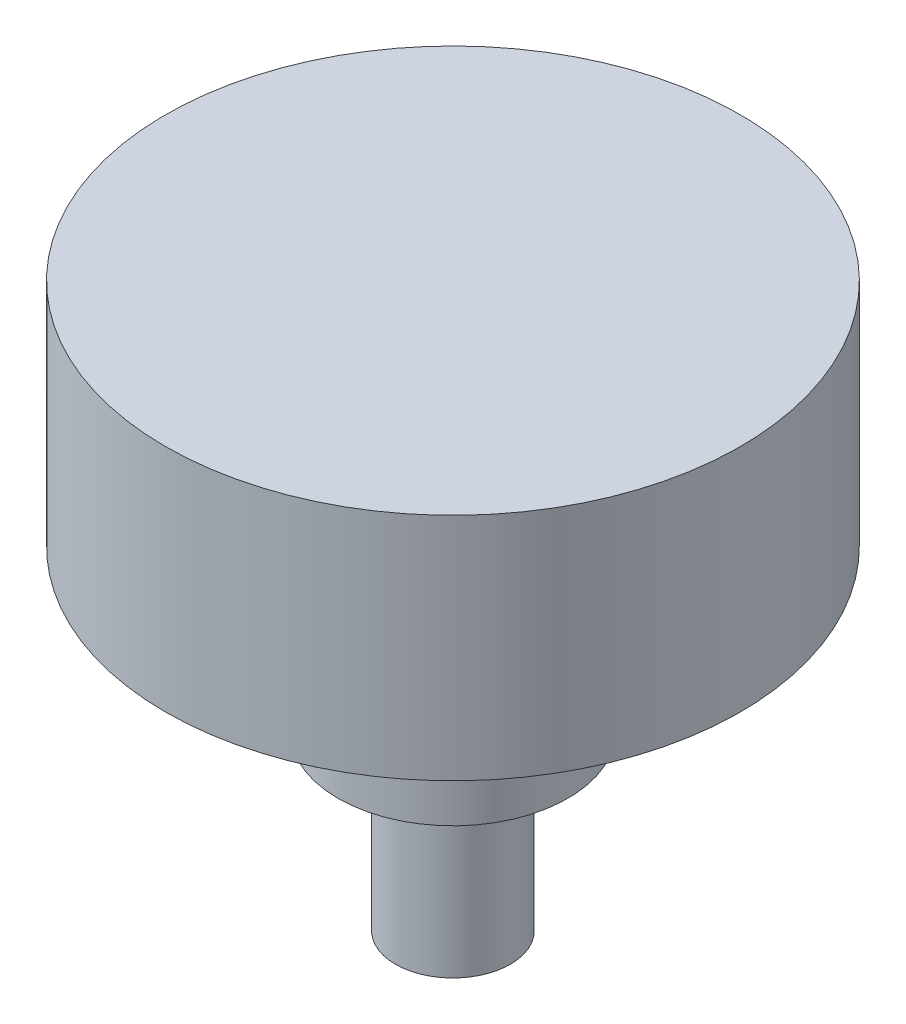
ISO-10303-21;
HEADER;
FILE_DESCRIPTION(('STEP AP214'),'2;1');
FILE_NAME('part.step','',(''),(''),'','','');
FILE_SCHEMA(('AUTOMOTIVE_DESIGN { 1 0 10303 214 1 1 1 1 }'));
ENDSEC;
DATA;
#1=APPLICATION_CONTEXT('core data for automotive mechanical design processes');
#2=APPLICATION_PROTOCOL_DEFINITION('international standard','automotive_design',2000,#1);
#3=PRODUCT_CONTEXT('',#1,'mechanical');
#4=PRODUCT('Part','Part','',(#3));
#5=PRODUCT_RELATED_PRODUCT_CATEGORY('part','',(#4));
#6=PRODUCT_DEFINITION_FORMATION('','',#4);
#7=PRODUCT_DEFINITION_CONTEXT('part definition',#1,'design');
#8=PRODUCT_DEFINITION('design','',#6,#7);
#9=PRODUCT_DEFINITION_SHAPE('','',#8);
#10=(LENGTH_UNIT() NAMED_UNIT(*) SI_UNIT(.MILLI.,.METRE.));
#11=(NAMED_UNIT(*) PLANE_ANGLE_UNIT() SI_UNIT($,.RADIAN.));
#12=(NAMED_UNIT(*) SI_UNIT($,.STERADIAN.) SOLID_ANGLE_UNIT());
#13=UNCERTAINTY_MEASURE_WITH_UNIT(LENGTH_MEASURE(1.E-05),#10,'distance_accuracy_value','');
#14=(GEOMETRIC_REPRESENTATION_CONTEXT(3) GLOBAL_UNCERTAINTY_ASSIGNED_CONTEXT((#13)) GLOBAL_UNIT_ASSIGNED_CONTEXT((#10,
#11,#12)) REPRESENTATION_CONTEXT('',''));
#15=CARTESIAN_POINT('',(0.,0.,0.));
#16=DIRECTION('',(0.,0.,1.));
#17=DIRECTION('',(1.,0.,0.));
#18=AXIS2_PLACEMENT_3D('',#15,#16,#17);
#19=CARTESIAN_POINT('',(0.,-13.97,0.));
#20=DIRECTION('',(0.,-1.,0.));
#21=DIRECTION('',(0.,0.,-1.));
#22=AXIS2_PLACEMENT_3D('',#19,#20,#21);
#23=PLANE('',#22);
#24=CARTESIAN_POINT('',(0.,-13.97,0.));
#25=DIRECTION('',(0.,1.,0.));
#26=DIRECTION('',(0.,0.,1.));
#27=AXIS2_PLACEMENT_3D('',#24,#25,#26);
#28=CIRCLE('',#27,3.175);
#29=CARTESIAN_POINT('',(0.,-13.97,3.17499999999999));
#30=VERTEX_POINT('',#29);
#31=EDGE_CURVE('E18',#30,#30,#28,.T.);
#32=ORIENTED_EDGE('',*,*,#31,.F.);
#33=EDGE_LOOP('',(#32));
#34=FACE_BOUND('',#33,.T.);
#35=ADVANCED_FACE('F15',(#34),#23,.T.);
#36=CARTESIAN_POINT('',(0.,22.8103363137515,0.));
#37=DIRECTION('',(0.,1.,0.));
#38=DIRECTION('',(0.,0.,1.));
#39=AXIS2_PLACEMENT_3D('',#36,#37,#38);
#40=CYLINDRICAL_SURFACE('',#39,3.175);
#41=ORIENTED_EDGE('',*,*,#31,.T.);
#42=EDGE_LOOP('',(#41));
#43=FACE_BOUND('',#42,.T.);
#44=CARTESIAN_POINT('',(0.,-4.445,0.));
#45=DIRECTION('',(0.,1.,0.));
#46=DIRECTION('',(0.,0.,1.));
#47=AXIS2_PLACEMENT_3D('',#44,#45,#46);
#48=CIRCLE('',#47,3.175);
#49=CARTESIAN_POINT('',(0.,-4.445,3.17499999999999));
#50=VERTEX_POINT('',#49);
#51=EDGE_CURVE('E34',#50,#50,#48,.T.);
#52=ORIENTED_EDGE('',*,*,#51,.F.);
#53=EDGE_LOOP('',(#52));
#54=FACE_BOUND('',#53,.T.);
#55=ADVANCED_FACE('F41',(#43,#54),#40,.T.);
#56=CARTESIAN_POINT('',(0.,-4.445,3.17499999999999));
#57=DIRECTION('',(0.,-1.,0.));
#58=DIRECTION('',(0.,0.,-1.));
#59=AXIS2_PLACEMENT_3D('',#56,#57,#58);
#60=PLANE('',#59);
#61=CARTESIAN_POINT('',(0.,-4.445,0.));
#62=DIRECTION('',(0.,1.,0.));
#63=DIRECTION('',(0.,0.,1.));
#64=AXIS2_PLACEMENT_3D('',#61,#62,#63);
#65=CIRCLE('',#64,6.35);
#66=CARTESIAN_POINT('',(0.,-4.445,6.34999999999999));
#67=VERTEX_POINT('',#66);
#68=EDGE_CURVE('E32',#67,#67,#65,.T.);
#69=ORIENTED_EDGE('',*,*,#68,.F.);
#70=EDGE_LOOP('',(#69));
#71=FACE_BOUND('',#70,.T.);
#72=ORIENTED_EDGE('',*,*,#51,.T.);
#73=EDGE_LOOP('',(#72));
#74=FACE_BOUND('',#73,.T.);
#75=ADVANCED_FACE('F49',(#71,#74),#60,.T.);
#76=CARTESIAN_POINT('',(0.,22.8103363137515,0.));
#77=DIRECTION('',(0.,1.,0.));
#78=DIRECTION('',(0.,0.,1.));
#79=AXIS2_PLACEMENT_3D('',#76,#77,#78);
#80=CYLINDRICAL_SURFACE('',#79,6.35);
#81=ORIENTED_EDGE('',*,*,#68,.T.);
#82=EDGE_LOOP('',(#81));
#83=FACE_BOUND('',#82,.T.);
#84=CARTESIAN_POINT('',(0.,4.445,0.));
#85=DIRECTION('',(0.,1.,0.));
#86=DIRECTION('',(0.,0.,1.));
#87=AXIS2_PLACEMENT_3D('',#84,#85,#86);
#88=CIRCLE('',#87,6.35);
#89=CARTESIAN_POINT('',(0.,4.445,6.35));
#90=VERTEX_POINT('',#89);
#91=EDGE_CURVE('E27',#90,#90,#88,.T.);
#92=ORIENTED_EDGE('',*,*,#91,.F.);
#93=EDGE_LOOP('',(#92));
#94=FACE_BOUND('',#93,.T.);
#95=ADVANCED_FACE('F63',(#83,#94),#80,.T.);
#96=CARTESIAN_POINT('',(0.,4.445,6.34999999999999));
#97=DIRECTION('',(0.,-1.,0.));
#98=DIRECTION('',(0.,0.,-1.));
#99=AXIS2_PLACEMENT_3D('',#96,#97,#98);
#100=PLANE('',#99);
#101=CARTESIAN_POINT('',(0.,4.445,0.));
#102=DIRECTION('',(0.,1.,0.));
#103=DIRECTION('',(0.,0.,1.));
#104=AXIS2_PLACEMENT_3D('',#101,#102,#103);
#105=CIRCLE('',#104,15.875);
#106=CARTESIAN_POINT('',(0.,4.445,15.875));
#107=VERTEX_POINT('',#106);
#108=EDGE_CURVE('E22',#107,#107,#105,.T.);
#109=ORIENTED_EDGE('',*,*,#108,.F.);
#110=EDGE_LOOP('',(#109));
#111=FACE_BOUND('',#110,.T.);
#112=ORIENTED_EDGE('',*,*,#91,.T.);
#113=EDGE_LOOP('',(#112));
#114=FACE_BOUND('',#113,.T.);
#115=ADVANCED_FACE('F57',(#111,#114),#100,.T.);
#116=CARTESIAN_POINT('',(0.,22.8103363137515,0.));
#117=DIRECTION('',(0.,1.,0.));
#118=DIRECTION('',(0.,0.,1.));
#119=AXIS2_PLACEMENT_3D('',#116,#117,#118);
#120=CYLINDRICAL_SURFACE('',#119,15.875);
#121=ORIENTED_EDGE('',*,*,#108,.T.);
#122=EDGE_LOOP('',(#121));
#123=FACE_BOUND('',#122,.T.);
#124=CARTESIAN_POINT('',(0.,17.145,0.));
#125=DIRECTION('',(0.,1.,0.));
#126=DIRECTION('',(0.,0.,1.));
#127=AXIS2_PLACEMENT_3D('',#124,#125,#126);
#128=CIRCLE('',#127,15.875);
#129=CARTESIAN_POINT('',(0.,17.145,15.875));
#130=VERTEX_POINT('',#129);
#131=EDGE_CURVE('E10',#130,#130,#128,.T.);
#132=ORIENTED_EDGE('',*,*,#131,.F.);
#133=EDGE_LOOP('',(#132));
#134=FACE_BOUND('',#133,.T.);
#135=ADVANCED_FACE('F52',(#123,#134),#120,.T.);
#136=CARTESIAN_POINT('',(0.,17.145,15.875));
#137=DIRECTION('',(0.,1.,0.));
#138=DIRECTION('',(0.,0.,1.));
#139=AXIS2_PLACEMENT_3D('',#136,#137,#138);
#140=PLANE('',#139);
#141=ORIENTED_EDGE('',*,*,#131,.T.);
#142=EDGE_LOOP('',(#141));
#143=FACE_BOUND('',#142,.T.);
#144=ADVANCED_FACE('F50',(#143),#140,.T.);
#145=CLOSED_SHELL('',(#35,#55,#75,#95,#115,#135,#144));
#146=MANIFOLD_SOLID_BREP('B1',#145);
#147=ADVANCED_BREP_SHAPE_REPRESENTATION('',(#18,#146),#14);
#148=SHAPE_DEFINITION_REPRESENTATION(#9,#147);
ENDSEC;
END-ISO-10303-21;
